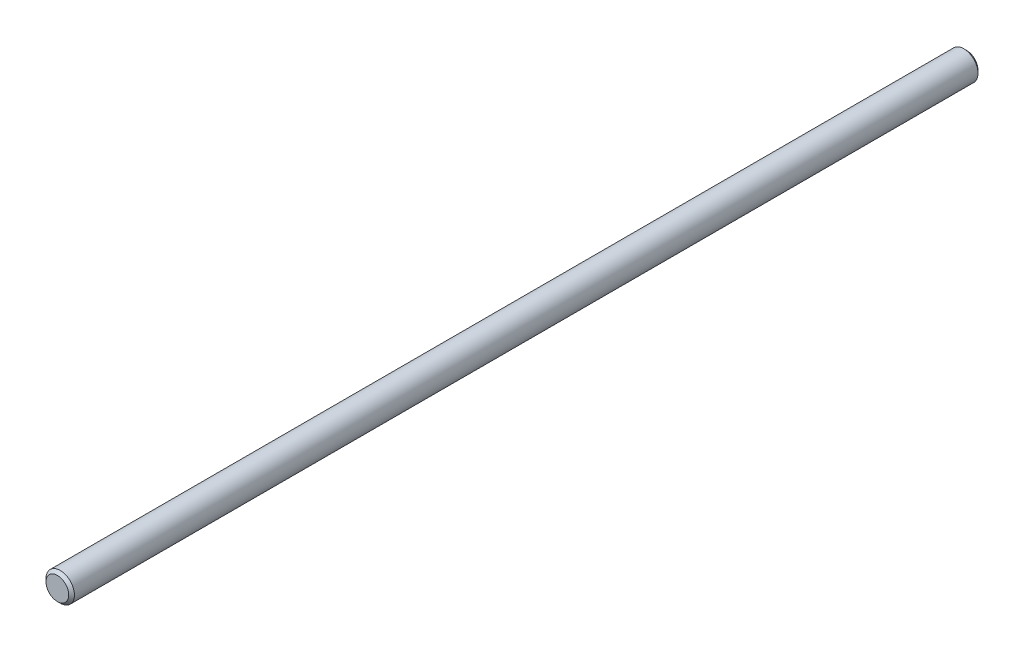
ISO-10303-21;
HEADER;
FILE_DESCRIPTION(('STEP AP214'),'2;1');
FILE_NAME('part.step','',(''),(''),'','','');
FILE_SCHEMA(('AUTOMOTIVE_DESIGN { 1 0 10303 214 1 1 1 1 }'));
ENDSEC;
DATA;
#1=APPLICATION_CONTEXT('core data for automotive mechanical design processes');
#2=APPLICATION_PROTOCOL_DEFINITION('international standard','automotive_design',2000,#1);
#3=PRODUCT_CONTEXT('',#1,'mechanical');
#4=PRODUCT('Part','Part','',(#3));
#5=PRODUCT_RELATED_PRODUCT_CATEGORY('part','',(#4));
#6=PRODUCT_DEFINITION_FORMATION('','',#4);
#7=PRODUCT_DEFINITION_CONTEXT('part definition',#1,'design');
#8=PRODUCT_DEFINITION('design','',#6,#7);
#9=PRODUCT_DEFINITION_SHAPE('','',#8);
#10=(LENGTH_UNIT() NAMED_UNIT(*) SI_UNIT(.MILLI.,.METRE.));
#11=(NAMED_UNIT(*) PLANE_ANGLE_UNIT() SI_UNIT($,.RADIAN.));
#12=(NAMED_UNIT(*) SI_UNIT($,.STERADIAN.) SOLID_ANGLE_UNIT());
#13=UNCERTAINTY_MEASURE_WITH_UNIT(LENGTH_MEASURE(1.E-05),#10,'distance_accuracy_value','');
#14=(GEOMETRIC_REPRESENTATION_CONTEXT(3) GLOBAL_UNCERTAINTY_ASSIGNED_CONTEXT((#13)) GLOBAL_UNIT_ASSIGNED_CONTEXT((#10,
#11,#12)) REPRESENTATION_CONTEXT('',''));
#15=CARTESIAN_POINT('',(0.,0.,0.));
#16=DIRECTION('',(0.,0.,1.));
#17=DIRECTION('',(1.,0.,0.));
#18=AXIS2_PLACEMENT_3D('',#15,#16,#17);
#19=CARTESIAN_POINT('',(0.,0.,152.4));
#20=DIRECTION('',(0.,0.,-1.));
#21=DIRECTION('',(-1.,0.,0.));
#22=AXIS2_PLACEMENT_3D('',#19,#20,#21);
#23=CYLINDRICAL_SURFACE('',#22,4.7625);
#24=CARTESIAN_POINT('',(0.,0.,-151.4475));
#25=DIRECTION('',(0.,0.,1.));
#26=DIRECTION('',(1.,0.,0.));
#27=AXIS2_PLACEMENT_3D('',#24,#25,#26);
#28=CIRCLE('',#27,4.7625);
#29=CARTESIAN_POINT('',(4.7625,0.,-151.4475));
#30=VERTEX_POINT('',#29);
#31=EDGE_CURVE('E46',#30,#30,#28,.T.);
#32=ORIENTED_EDGE('',*,*,#31,.T.);
#33=EDGE_LOOP('',(#32));
#34=FACE_BOUND('',#33,.T.);
#35=CARTESIAN_POINT('',(0.,0.,151.4475));
#36=DIRECTION('',(0.,0.,1.));
#37=DIRECTION('',(1.,0.,0.));
#38=AXIS2_PLACEMENT_3D('',#35,#36,#37);
#39=CIRCLE('',#38,4.7625);
#40=CARTESIAN_POINT('',(4.7625,0.,151.4475));
#41=VERTEX_POINT('',#40);
#42=EDGE_CURVE('E50',#41,#41,#39,.F.);
#43=ORIENTED_EDGE('',*,*,#42,.T.);
#44=EDGE_LOOP('',(#43));
#45=FACE_BOUND('',#44,.T.);
#46=ADVANCED_FACE('F35',(#34,#45),#23,.T.);
#47=CARTESIAN_POINT('',(0.,0.,152.4));
#48=DIRECTION('',(0.,0.,1.));
#49=DIRECTION('',(1.,0.,0.));
#50=AXIS2_PLACEMENT_3D('',#47,#48,#49);
#51=PLANE('',#50);
#52=CARTESIAN_POINT('',(0.,0.,152.4));
#53=DIRECTION('',(0.,0.,1.));
#54=DIRECTION('',(1.,0.,0.));
#55=AXIS2_PLACEMENT_3D('',#52,#53,#54);
#56=CIRCLE('',#55,3.81000000000012);
#57=CARTESIAN_POINT('',(3.81000000000012,0.,152.4));
#58=VERTEX_POINT('',#57);
#59=EDGE_CURVE('E10',#58,#58,#56,.T.);
#60=ORIENTED_EDGE('',*,*,#59,.T.);
#61=EDGE_LOOP('',(#60));
#62=FACE_BOUND('',#61,.T.);
#63=ADVANCED_FACE('F66',(#62),#51,.T.);
#64=CARTESIAN_POINT('',(0.,0.,-152.4));
#65=DIRECTION('',(0.,0.,1.));
#66=DIRECTION('',(1.,0.,0.));
#67=AXIS2_PLACEMENT_3D('',#64,#65,#66);
#68=PLANE('',#67);
#69=CARTESIAN_POINT('',(0.,0.,-152.4));
#70=DIRECTION('',(0.,0.,1.));
#71=DIRECTION('',(1.,0.,0.));
#72=AXIS2_PLACEMENT_3D('',#69,#70,#71);
#73=CIRCLE('',#72,3.8099999999997);
#74=CARTESIAN_POINT('',(3.8099999999997,0.,-152.4));
#75=VERTEX_POINT('',#74);
#76=EDGE_CURVE('E42',#75,#75,#73,.F.);
#77=ORIENTED_EDGE('',*,*,#76,.T.);
#78=EDGE_LOOP('',(#77));
#79=FACE_BOUND('',#78,.T.);
#80=ADVANCED_FACE('F63',(#79),#68,.F.);
#81=CARTESIAN_POINT('',(0.,0.,-151.4475));
#82=DIRECTION('',(0.,0.,1.));
#83=DIRECTION('',(1.,0.,0.));
#84=AXIS2_PLACEMENT_3D('',#81,#82,#83);
#85=CONICAL_SURFACE('',#84,4.7625,0.785398163397447);
#86=ORIENTED_EDGE('',*,*,#76,.F.);
#87=EDGE_LOOP('',(#86));
#88=FACE_BOUND('',#87,.T.);
#89=ORIENTED_EDGE('',*,*,#31,.F.);
#90=EDGE_LOOP('',(#89));
#91=FACE_BOUND('',#90,.T.);
#92=ADVANCED_FACE('F59',(#88,#91),#85,.T.);
#93=CARTESIAN_POINT('',(0.,0.,152.4));
#94=DIRECTION('',(0.,0.,-1.));
#95=DIRECTION('',(-1.,0.,0.));
#96=AXIS2_PLACEMENT_3D('',#93,#94,#95);
#97=CONICAL_SURFACE('',#96,3.81000000000012,0.785398163397447);
#98=ORIENTED_EDGE('',*,*,#42,.F.);
#99=EDGE_LOOP('',(#98));
#100=FACE_BOUND('',#99,.T.);
#101=ORIENTED_EDGE('',*,*,#59,.F.);
#102=EDGE_LOOP('',(#101));
#103=FACE_BOUND('',#102,.T.);
#104=ADVANCED_FACE('F37',(#100,#103),#97,.T.);
#105=CLOSED_SHELL('',(#46,#63,#80,#92,#104));
#106=MANIFOLD_SOLID_BREP('B2',#105);
#107=ADVANCED_BREP_SHAPE_REPRESENTATION('',(#18,#106),#14);
#108=SHAPE_DEFINITION_REPRESENTATION(#9,#107);
ENDSEC;
END-ISO-10303-21;
